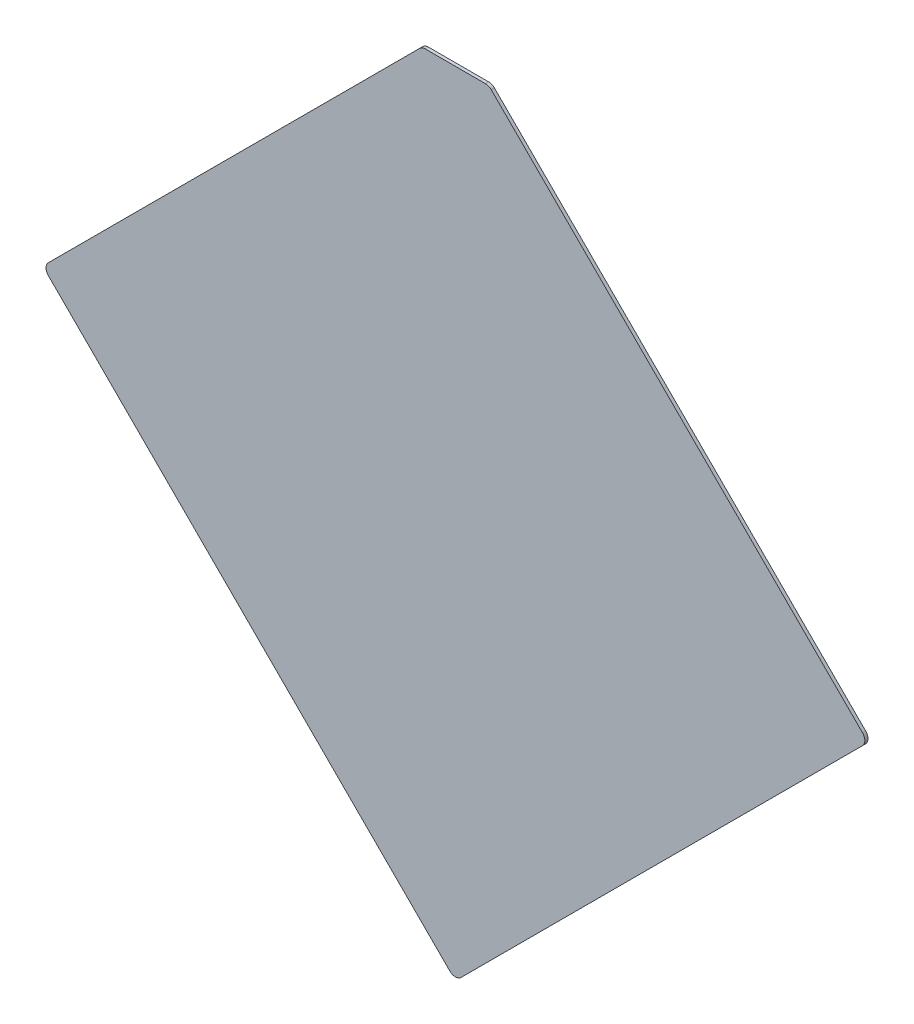
ISO-10303-21;
HEADER;
FILE_DESCRIPTION(('STEP AP214'),'2;1');
FILE_NAME('part.step','',(''),(''),'','','');
FILE_SCHEMA(('AUTOMOTIVE_DESIGN { 1 0 10303 214 1 1 1 1 }'));
ENDSEC;
DATA;
#1=APPLICATION_CONTEXT('core data for automotive mechanical design processes');
#2=APPLICATION_PROTOCOL_DEFINITION('international standard','automotive_design',2000,#1);
#3=PRODUCT_CONTEXT('',#1,'mechanical');
#4=PRODUCT('Part','Part','',(#3));
#5=PRODUCT_RELATED_PRODUCT_CATEGORY('part','',(#4));
#6=PRODUCT_DEFINITION_FORMATION('','',#4);
#7=PRODUCT_DEFINITION_CONTEXT('part definition',#1,'design');
#8=PRODUCT_DEFINITION('design','',#6,#7);
#9=PRODUCT_DEFINITION_SHAPE('','',#8);
#10=(LENGTH_UNIT() NAMED_UNIT(*) SI_UNIT(.MILLI.,.METRE.));
#11=(NAMED_UNIT(*) PLANE_ANGLE_UNIT() SI_UNIT($,.RADIAN.));
#12=(NAMED_UNIT(*) SI_UNIT($,.STERADIAN.) SOLID_ANGLE_UNIT());
#13=UNCERTAINTY_MEASURE_WITH_UNIT(LENGTH_MEASURE(1.E-05),#10,'distance_accuracy_value','');
#14=(GEOMETRIC_REPRESENTATION_CONTEXT(3) GLOBAL_UNCERTAINTY_ASSIGNED_CONTEXT((#13)) GLOBAL_UNIT_ASSIGNED_CONTEXT((#10,
#11,#12)) REPRESENTATION_CONTEXT('',''));
#15=CARTESIAN_POINT('',(0.,0.,0.));
#16=DIRECTION('',(0.,0.,1.));
#17=DIRECTION('',(1.,0.,0.));
#18=AXIS2_PLACEMENT_3D('',#15,#16,#17);
#19=CARTESIAN_POINT('',(5.28167,5.06167,0.81916));
#20=DIRECTION('',(0.,0.,-1.));
#21=DIRECTION('',(-1.,0.,0.));
#22=AXIS2_PLACEMENT_3D('',#19,#20,#21);
#23=PLANE('',#22);
#24=CARTESIAN_POINT('',(5.473091356237,7.415833056034,0.81916));
#25=DIRECTION('',(0.,0.,-1.));
#26=DIRECTION('',(-1.,0.,0.));
#27=AXIS2_PLACEMENT_3D('',#24,#25,#26);
#28=CIRCLE('',#27,0.05);
#29=CARTESIAN_POINT('',(5.473091356237,7.465833056034,0.81916));
#30=VERTEX_POINT('',#29);
#31=CARTESIAN_POINT('',(5.5084466952965,7.4511883950935,0.81916));
#32=VERTEX_POINT('',#31);
#33=EDGE_CURVE('E101',#30,#32,#28,.T.);
#34=ORIENTED_EDGE('',*,*,#33,.F.);
#35=DIRECTION('',(1.,0.,0.));
#36=VECTOR('',#35,1.);
#37=CARTESIAN_POINT('',(5.493802034356,7.465833056034,0.81916));
#38=LINE('',#37,#36);
#39=CARTESIAN_POINT('',(5.090248643763,7.465833056034,0.81916));
#40=VERTEX_POINT('',#39);
#41=EDGE_CURVE('E98',#30,#40,#38,.F.);
#42=ORIENTED_EDGE('',*,*,#41,.T.);
#43=CARTESIAN_POINT('',(5.090248643763,7.415833056034,0.81916));
#44=DIRECTION('',(0.,0.,1.));
#45=DIRECTION('',(1.,0.,0.));
#46=AXIS2_PLACEMENT_3D('',#43,#44,#45);
#47=CIRCLE('',#46,0.05);
#48=CARTESIAN_POINT('',(5.05489330470359,7.45118839509341,0.81916));
#49=VERTEX_POINT('',#48);
#50=EDGE_CURVE('E20',#49,#40,#47,.F.);
#51=ORIENTED_EDGE('',*,*,#50,.F.);
#52=DIRECTION('',(0.707106781186548,0.707106781186548,0.));
#53=VECTOR('',#52,1.);
#54=CARTESIAN_POINT('',(5.28167,7.67796509039,0.81916));
#55=LINE('',#54,#53);
#56=CARTESIAN_POINT('',(2.700730248669,5.097025339059,0.81916));
#57=VERTEX_POINT('',#56);
#58=EDGE_CURVE('E109',#49,#57,#55,.F.);
#59=ORIENTED_EDGE('',*,*,#58,.T.);
#60=CARTESIAN_POINT('',(2.736085587728,5.06167,0.81916));
#61=DIRECTION('',(0.,0.,-1.));
#62=DIRECTION('',(-1.,0.,0.));
#63=AXIS2_PLACEMENT_3D('',#60,#61,#62);
#64=CIRCLE('',#63,0.05);
#65=CARTESIAN_POINT('',(2.70073024866884,5.02631466094084,0.81916));
#66=VERTEX_POINT('',#65);
#67=EDGE_CURVE('E118',#66,#57,#64,.T.);
#68=ORIENTED_EDGE('',*,*,#67,.F.);
#69=DIRECTION('',(-0.707106781186548,0.707106781186548,0.));
#70=VECTOR('',#69,1.);
#71=CARTESIAN_POINT('',(2.66537490961,5.06167,0.81916));
#72=LINE('',#71,#70);
#73=CARTESIAN_POINT('',(5.246314660941,2.480730248669,0.81916));
#74=VERTEX_POINT('',#73);
#75=EDGE_CURVE('E124',#66,#74,#72,.F.);
#76=ORIENTED_EDGE('',*,*,#75,.T.);
#77=CARTESIAN_POINT('',(5.28167,2.516085587728,0.81916));
#78=DIRECTION('',(0.,0.,-1.));
#79=DIRECTION('',(-1.,0.,0.));
#80=AXIS2_PLACEMENT_3D('',#77,#78,#79);
#81=CIRCLE('',#80,0.05);
#82=CARTESIAN_POINT('',(5.31702533905916,2.48073024866884,0.81916));
#83=VERTEX_POINT('',#82);
#84=EDGE_CURVE('E128',#83,#74,#81,.T.);
#85=ORIENTED_EDGE('',*,*,#84,.F.);
#86=DIRECTION('',(-0.707106781186548,-0.707106781186548,0.));
#87=VECTOR('',#86,1.);
#88=CARTESIAN_POINT('',(7.89796509039,5.06167,0.81916));
#89=LINE('',#88,#87);
#90=CARTESIAN_POINT('',(7.862609751331,5.026314660941,0.81916));
#91=VERTEX_POINT('',#90);
#92=EDGE_CURVE('E131',#83,#91,#89,.F.);
#93=ORIENTED_EDGE('',*,*,#92,.T.);
#94=CARTESIAN_POINT('',(7.827254412272,5.06167,0.81916));
#95=DIRECTION('',(0.,0.,-1.));
#96=DIRECTION('',(-1.,0.,0.));
#97=AXIS2_PLACEMENT_3D('',#94,#95,#96);
#98=CIRCLE('',#97,0.05);
#99=CARTESIAN_POINT('',(7.86260975133116,5.09702533905916,0.81916));
#100=VERTEX_POINT('',#99);
#101=EDGE_CURVE('E135',#100,#91,#98,.T.);
#102=ORIENTED_EDGE('',*,*,#101,.F.);
#103=DIRECTION('',(0.707106781186548,-0.707106781186548,0.));
#104=VECTOR('',#103,1.);
#105=CARTESIAN_POINT('',(5.28167,7.67796509039,0.81916));
#106=LINE('',#105,#104);
#107=EDGE_CURVE('E138',#100,#32,#106,.F.);
#108=ORIENTED_EDGE('',*,*,#107,.T.);
#109=EDGE_LOOP('',(#34,#42,#51,#59,#68,#76,#85,#93,#102,#108));
#110=FACE_BOUND('',#109,.T.);
#111=ADVANCED_FACE('F17',(#110),#23,.F.);
#112=CARTESIAN_POINT('',(5.493802034356,7.465833056034,0.79916));
#113=DIRECTION('',(0.,-1.,0.));
#114=DIRECTION('',(1.,0.,0.));
#115=AXIS2_PLACEMENT_3D('',#112,#113,#114);
#116=PLANE('',#115);
#117=DIRECTION('',(0.,0.,-1.));
#118=VECTOR('',#117,1.);
#119=CARTESIAN_POINT('',(5.473091356237,7.465833056034,0.79916));
#120=LINE('',#119,#118);
#121=CARTESIAN_POINT('',(5.473091356237,7.465833056034,0.79916));
#122=VERTEX_POINT('',#121);
#123=EDGE_CURVE('E104',#122,#30,#120,.F.);
#124=ORIENTED_EDGE('',*,*,#123,.F.);
#125=DIRECTION('',(-1.,0.,0.));
#126=VECTOR('',#125,1.);
#127=CARTESIAN_POINT('',(5.28167,7.465833056034,0.79916));
#128=LINE('',#127,#126);
#129=CARTESIAN_POINT('',(5.090248643763,7.465833056034,0.79916));
#130=VERTEX_POINT('',#129);
#131=EDGE_CURVE('E108',#130,#122,#128,.F.);
#132=ORIENTED_EDGE('',*,*,#131,.F.);
#133=DIRECTION('',(0.,0.,1.));
#134=VECTOR('',#133,1.);
#135=CARTESIAN_POINT('',(5.090248643763,7.465833056034,0.79916));
#136=LINE('',#135,#134);
#137=EDGE_CURVE('E97',#40,#130,#136,.F.);
#138=ORIENTED_EDGE('',*,*,#137,.F.);
#139=ORIENTED_EDGE('',*,*,#41,.F.);
#140=EDGE_LOOP('',(#124,#132,#138,#139));
#141=FACE_BOUND('',#140,.T.);
#142=ADVANCED_FACE('F106',(#141),#116,.F.);
#143=CARTESIAN_POINT('',(5.473091356237,7.415833056034,0.79916));
#144=DIRECTION('',(0.,0.,-1.));
#145=DIRECTION('',(-1.,0.,0.));
#146=AXIS2_PLACEMENT_3D('',#143,#144,#145);
#147=CYLINDRICAL_SURFACE('',#146,0.05);
#148=ORIENTED_EDGE('',*,*,#33,.T.);
#149=DIRECTION('',(0.,0.,1.));
#150=VECTOR('',#149,1.);
#151=CARTESIAN_POINT('',(5.5084466952965,7.4511883950935,0.79916));
#152=LINE('',#151,#150);
#153=CARTESIAN_POINT('',(5.50844669529675,7.45118839509375,0.79916));
#154=VERTEX_POINT('',#153);
#155=EDGE_CURVE('E136',#32,#154,#152,.F.);
#156=ORIENTED_EDGE('',*,*,#155,.T.);
#157=CARTESIAN_POINT('',(5.473091356237,7.415833056034,0.79916));
#158=DIRECTION('',(0.,0.,-1.));
#159=DIRECTION('',(-1.,0.,0.));
#160=AXIS2_PLACEMENT_3D('',#157,#158,#159);
#161=CIRCLE('',#160,0.05);
#162=EDGE_CURVE('E155',#122,#154,#161,.T.);
#163=ORIENTED_EDGE('',*,*,#162,.F.);
#164=ORIENTED_EDGE('',*,*,#123,.T.);
#165=EDGE_LOOP('',(#148,#156,#163,#164));
#166=FACE_BOUND('',#165,.T.);
#167=ADVANCED_FACE('F164',(#166),#147,.T.);
#168=CARTESIAN_POINT('',(5.28167,7.67796509039,0.79916));
#169=DIRECTION('',(-0.707106781186548,-0.707106781186548,0.));
#170=DIRECTION('',(0.707106781186548,-0.707106781186548,0.));
#171=AXIS2_PLACEMENT_3D('',#168,#169,#170);
#172=PLANE('',#171);
#173=ORIENTED_EDGE('',*,*,#155,.F.);
#174=ORIENTED_EDGE('',*,*,#107,.F.);
#175=DIRECTION('',(0.,0.,-1.));
#176=VECTOR('',#175,1.);
#177=CARTESIAN_POINT('',(7.86260975133133,5.09702533905933,0.79916));
#178=LINE('',#177,#176);
#179=CARTESIAN_POINT('',(7.86260975133117,5.09702533905916,0.79916));
#180=VERTEX_POINT('',#179);
#181=EDGE_CURVE('E132',#180,#100,#178,.F.);
#182=ORIENTED_EDGE('',*,*,#181,.F.);
#183=DIRECTION('',(0.707106781186397,-0.707106781186698,0.));
#184=VECTOR('',#183,1.);
#185=CARTESIAN_POINT('',(5.508446695297,7.451188395094,0.79916));
#186=LINE('',#185,#184);
#187=EDGE_CURVE('E154',#154,#180,#186,.T.);
#188=ORIENTED_EDGE('',*,*,#187,.F.);
#189=EDGE_LOOP('',(#173,#174,#182,#188));
#190=FACE_BOUND('',#189,.T.);
#191=ADVANCED_FACE('F168',(#190),#172,.F.);
#192=CARTESIAN_POINT('',(7.827254412272,5.06167,0.79916));
#193=DIRECTION('',(0.,0.,-1.));
#194=DIRECTION('',(-1.,0.,0.));
#195=AXIS2_PLACEMENT_3D('',#192,#193,#194);
#196=CYLINDRICAL_SURFACE('',#195,0.05);
#197=ORIENTED_EDGE('',*,*,#101,.T.);
#198=DIRECTION('',(0.,0.,1.));
#199=VECTOR('',#198,1.);
#200=CARTESIAN_POINT('',(7.862609751331,5.026314660941,0.79916));
#201=LINE('',#200,#199);
#202=CARTESIAN_POINT('',(7.862609751331,5.026314660941,0.79916));
#203=VERTEX_POINT('',#202);
#204=EDGE_CURVE('E129',#91,#203,#201,.F.);
#205=ORIENTED_EDGE('',*,*,#204,.T.);
#206=CARTESIAN_POINT('',(7.827254412272,5.06167,0.79916));
#207=DIRECTION('',(0.,0.,-1.));
#208=DIRECTION('',(-1.,0.,0.));
#209=AXIS2_PLACEMENT_3D('',#206,#207,#208);
#210=CIRCLE('',#209,0.05);
#211=EDGE_CURVE('E151',#180,#203,#210,.T.);
#212=ORIENTED_EDGE('',*,*,#211,.F.);
#213=ORIENTED_EDGE('',*,*,#181,.T.);
#214=EDGE_LOOP('',(#197,#205,#212,#213));
#215=FACE_BOUND('',#214,.T.);
#216=ADVANCED_FACE('F199',(#215),#196,.T.);
#217=CARTESIAN_POINT('',(7.89796509039,5.06167,0.79916));
#218=DIRECTION('',(-0.707106781186548,0.707106781186548,0.));
#219=DIRECTION('',(-0.707106781186548,-0.707106781186548,0.));
#220=AXIS2_PLACEMENT_3D('',#217,#218,#219);
#221=PLANE('',#220);
#222=ORIENTED_EDGE('',*,*,#204,.F.);
#223=ORIENTED_EDGE('',*,*,#92,.F.);
#224=DIRECTION('',(0.,0.,-1.));
#225=VECTOR('',#224,1.);
#226=CARTESIAN_POINT('',(5.31702533905933,2.48073024866867,0.79916));
#227=LINE('',#226,#225);
#228=CARTESIAN_POINT('',(5.31702533905916,2.48073024866884,0.79916));
#229=VERTEX_POINT('',#228);
#230=EDGE_CURVE('E125',#229,#83,#227,.F.);
#231=ORIENTED_EDGE('',*,*,#230,.F.);
#232=DIRECTION('',(-0.707106781186548,-0.707106781186548,0.));
#233=VECTOR('',#232,1.);
#234=CARTESIAN_POINT('',(7.862609751331,5.026314660941,0.79916));
#235=LINE('',#234,#233);
#236=EDGE_CURVE('E150',#203,#229,#235,.T.);
#237=ORIENTED_EDGE('',*,*,#236,.F.);
#238=EDGE_LOOP('',(#222,#223,#231,#237));
#239=FACE_BOUND('',#238,.T.);
#240=ADVANCED_FACE('F186',(#239),#221,.F.);
#241=CARTESIAN_POINT('',(5.28167,2.516085587728,0.79916));
#242=DIRECTION('',(0.,0.,-1.));
#243=DIRECTION('',(-1.,0.,0.));
#244=AXIS2_PLACEMENT_3D('',#241,#242,#243);
#245=CYLINDRICAL_SURFACE('',#244,0.05);
#246=ORIENTED_EDGE('',*,*,#84,.T.);
#247=DIRECTION('',(0.,0.,1.));
#248=VECTOR('',#247,1.);
#249=CARTESIAN_POINT('',(5.246314660941,2.480730248669,0.79916));
#250=LINE('',#249,#248);
#251=CARTESIAN_POINT('',(5.246314660941,2.480730248669,0.79916));
#252=VERTEX_POINT('',#251);
#253=EDGE_CURVE('E122',#74,#252,#250,.F.);
#254=ORIENTED_EDGE('',*,*,#253,.T.);
#255=CARTESIAN_POINT('',(5.28167,2.516085587728,0.79916));
#256=DIRECTION('',(0.,0.,-1.));
#257=DIRECTION('',(-1.,0.,0.));
#258=AXIS2_PLACEMENT_3D('',#255,#256,#257);
#259=CIRCLE('',#258,0.05);
#260=EDGE_CURVE('E147',#229,#252,#259,.T.);
#261=ORIENTED_EDGE('',*,*,#260,.F.);
#262=ORIENTED_EDGE('',*,*,#230,.T.);
#263=EDGE_LOOP('',(#246,#254,#261,#262));
#264=FACE_BOUND('',#263,.T.);
#265=ADVANCED_FACE('F189',(#264),#245,.T.);
#266=CARTESIAN_POINT('',(2.66537490961,5.06167,0.79916));
#267=DIRECTION('',(0.707106781186548,0.707106781186548,0.));
#268=DIRECTION('',(-0.707106781186548,0.707106781186548,0.));
#269=AXIS2_PLACEMENT_3D('',#266,#267,#268);
#270=PLANE('',#269);
#271=ORIENTED_EDGE('',*,*,#253,.F.);
#272=ORIENTED_EDGE('',*,*,#75,.F.);
#273=DIRECTION('',(0.,0.,-1.));
#274=VECTOR('',#273,1.);
#275=CARTESIAN_POINT('',(2.70073024866867,5.02631466094067,0.79916));
#276=LINE('',#275,#274);
#277=CARTESIAN_POINT('',(2.70073024866884,5.02631466094084,0.79916));
#278=VERTEX_POINT('',#277);
#279=EDGE_CURVE('E119',#278,#66,#276,.F.);
#280=ORIENTED_EDGE('',*,*,#279,.F.);
#281=DIRECTION('',(-0.707106781186548,0.707106781186548,0.));
#282=VECTOR('',#281,1.);
#283=CARTESIAN_POINT('',(5.246314660941,2.480730248669,0.79916));
#284=LINE('',#283,#282);
#285=EDGE_CURVE('E146',#252,#278,#284,.T.);
#286=ORIENTED_EDGE('',*,*,#285,.F.);
#287=EDGE_LOOP('',(#271,#272,#280,#286));
#288=FACE_BOUND('',#287,.T.);
#289=ADVANCED_FACE('F193',(#288),#270,.F.);
#290=CARTESIAN_POINT('',(2.736085587728,5.06167,0.79916));
#291=DIRECTION('',(0.,0.,-1.));
#292=DIRECTION('',(-1.,0.,0.));
#293=AXIS2_PLACEMENT_3D('',#290,#291,#292);
#294=CYLINDRICAL_SURFACE('',#293,0.05);
#295=ORIENTED_EDGE('',*,*,#67,.T.);
#296=DIRECTION('',(0.,0.,1.));
#297=VECTOR('',#296,1.);
#298=CARTESIAN_POINT('',(2.700730248669,5.097025339059,0.79916));
#299=LINE('',#298,#297);
#300=CARTESIAN_POINT('',(2.700730248669,5.097025339059,0.79916));
#301=VERTEX_POINT('',#300);
#302=EDGE_CURVE('E112',#57,#301,#299,.F.);
#303=ORIENTED_EDGE('',*,*,#302,.T.);
#304=CARTESIAN_POINT('',(2.736085587728,5.06167,0.79916));
#305=DIRECTION('',(0.,0.,-1.));
#306=DIRECTION('',(-1.,0.,0.));
#307=AXIS2_PLACEMENT_3D('',#304,#305,#306);
#308=CIRCLE('',#307,0.05);
#309=EDGE_CURVE('E143',#278,#301,#308,.T.);
#310=ORIENTED_EDGE('',*,*,#309,.F.);
#311=ORIENTED_EDGE('',*,*,#279,.T.);
#312=EDGE_LOOP('',(#295,#303,#310,#311));
#313=FACE_BOUND('',#312,.T.);
#314=ADVANCED_FACE('F196',(#313),#294,.T.);
#315=CARTESIAN_POINT('',(5.28167,7.67796509039,0.79916));
#316=DIRECTION('',(0.707106781186548,-0.707106781186548,0.));
#317=DIRECTION('',(0.707106781186548,0.707106781186548,0.));
#318=AXIS2_PLACEMENT_3D('',#315,#316,#317);
#319=PLANE('',#318);
#320=DIRECTION('',(0.,0.,1.));
#321=VECTOR('',#320,1.);
#322=CARTESIAN_POINT('',(5.05489330470367,7.45118839509333,0.79916));
#323=LINE('',#322,#321);
#324=CARTESIAN_POINT('',(5.05489330470333,7.45118839509366,0.79916));
#325=VERTEX_POINT('',#324);
#326=EDGE_CURVE('E35',#325,#49,#323,.T.);
#327=ORIENTED_EDGE('',*,*,#326,.F.);
#328=DIRECTION('',(0.707106781186397,0.707106781186698,0.));
#329=VECTOR('',#328,1.);
#330=CARTESIAN_POINT('',(2.700730248669,5.097025339059,0.79916));
#331=LINE('',#330,#329);
#332=EDGE_CURVE('E26',#301,#325,#331,.T.);
#333=ORIENTED_EDGE('',*,*,#332,.F.);
#334=ORIENTED_EDGE('',*,*,#302,.F.);
#335=ORIENTED_EDGE('',*,*,#58,.F.);
#336=EDGE_LOOP('',(#327,#333,#334,#335));
#337=FACE_BOUND('',#336,.T.);
#338=ADVANCED_FACE('F197',(#337),#319,.F.);
#339=CARTESIAN_POINT('',(5.090248643763,7.415833056034,0.79916));
#340=DIRECTION('',(0.,0.,1.));
#341=DIRECTION('',(1.,0.,0.));
#342=AXIS2_PLACEMENT_3D('',#339,#340,#341);
#343=CYLINDRICAL_SURFACE('',#342,0.05);
#344=CARTESIAN_POINT('',(5.090248643763,7.415833056034,0.79916));
#345=DIRECTION('',(0.,0.,1.));
#346=DIRECTION('',(1.,0.,0.));
#347=AXIS2_PLACEMENT_3D('',#344,#345,#346);
#348=CIRCLE('',#347,0.05);
#349=EDGE_CURVE('E11',#325,#130,#348,.F.);
#350=ORIENTED_EDGE('',*,*,#349,.F.);
#351=ORIENTED_EDGE('',*,*,#326,.T.);
#352=ORIENTED_EDGE('',*,*,#50,.T.);
#353=ORIENTED_EDGE('',*,*,#137,.T.);
#354=EDGE_LOOP('',(#350,#351,#352,#353));
#355=FACE_BOUND('',#354,.T.);
#356=ADVANCED_FACE('F95',(#355),#343,.T.);
#357=CARTESIAN_POINT('',(5.28167,5.06167,0.79916));
#358=DIRECTION('',(0.,0.,-1.));
#359=DIRECTION('',(-1.,0.,0.));
#360=AXIS2_PLACEMENT_3D('',#357,#358,#359);
#361=PLANE('',#360);
#362=ORIENTED_EDGE('',*,*,#332,.T.);
#363=ORIENTED_EDGE('',*,*,#349,.T.);
#364=ORIENTED_EDGE('',*,*,#131,.T.);
#365=ORIENTED_EDGE('',*,*,#162,.T.);
#366=ORIENTED_EDGE('',*,*,#187,.T.);
#367=ORIENTED_EDGE('',*,*,#211,.T.);
#368=ORIENTED_EDGE('',*,*,#236,.T.);
#369=ORIENTED_EDGE('',*,*,#260,.T.);
#370=ORIENTED_EDGE('',*,*,#285,.T.);
#371=ORIENTED_EDGE('',*,*,#309,.T.);
#372=EDGE_LOOP('',(#362,#363,#364,#365,#366,#367,#368,#369,#370,#371));
#373=FACE_BOUND('',#372,.T.);
#374=ADVANCED_FACE('F174',(#373),#361,.T.);
#375=CLOSED_SHELL('',(#111,#142,#167,#191,#216,#240,#265,#289,#314,#338,#356,#374));
#376=MANIFOLD_SOLID_BREP('B1',#375);
#377=ADVANCED_BREP_SHAPE_REPRESENTATION('',(#18,#376),#14);
#378=SHAPE_DEFINITION_REPRESENTATION(#9,#377);
ENDSEC;
END-ISO-10303-21;
